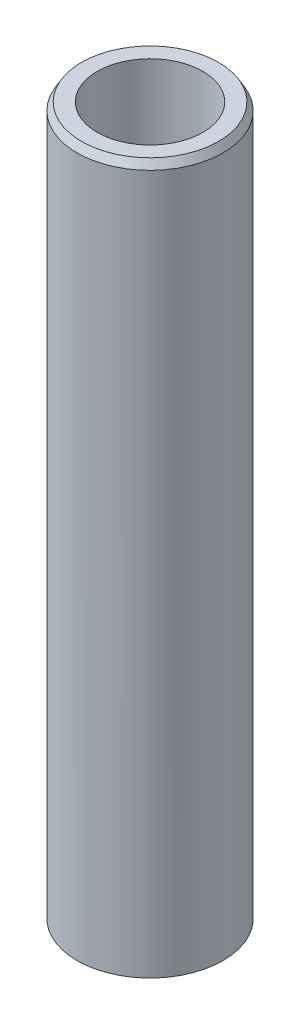
ISO-10303-21;
HEADER;
FILE_DESCRIPTION(('STEP AP214'),'2;1');
FILE_NAME('part.step','',(''),(''),'','','');
FILE_SCHEMA(('AUTOMOTIVE_DESIGN { 1 0 10303 214 1 1 1 1 }'));
ENDSEC;
DATA;
#1=APPLICATION_CONTEXT('core data for automotive mechanical design processes');
#2=APPLICATION_PROTOCOL_DEFINITION('international standard','automotive_design',2000,#1);
#3=PRODUCT_CONTEXT('',#1,'mechanical');
#4=PRODUCT('Part','Part','',(#3));
#5=PRODUCT_RELATED_PRODUCT_CATEGORY('part','',(#4));
#6=PRODUCT_DEFINITION_FORMATION('','',#4);
#7=PRODUCT_DEFINITION_CONTEXT('part definition',#1,'design');
#8=PRODUCT_DEFINITION('design','',#6,#7);
#9=PRODUCT_DEFINITION_SHAPE('','',#8);
#10=(LENGTH_UNIT() NAMED_UNIT(*) SI_UNIT(.MILLI.,.METRE.));
#11=(NAMED_UNIT(*) PLANE_ANGLE_UNIT() SI_UNIT($,.RADIAN.));
#12=(NAMED_UNIT(*) SI_UNIT($,.STERADIAN.) SOLID_ANGLE_UNIT());
#13=UNCERTAINTY_MEASURE_WITH_UNIT(LENGTH_MEASURE(1.E-05),#10,'distance_accuracy_value','');
#14=(GEOMETRIC_REPRESENTATION_CONTEXT(3) GLOBAL_UNCERTAINTY_ASSIGNED_CONTEXT((#13)) GLOBAL_UNIT_ASSIGNED_CONTEXT((#10,
#11,#12)) REPRESENTATION_CONTEXT('',''));
#15=CARTESIAN_POINT('',(0.,0.,0.));
#16=DIRECTION('',(0.,0.,1.));
#17=DIRECTION('',(1.,0.,0.));
#18=AXIS2_PLACEMENT_3D('',#15,#16,#17);
#19=CARTESIAN_POINT('',(0.,146.294640495275,0.));
#20=DIRECTION('',(0.,-1.,0.));
#21=DIRECTION('',(0.,0.,-1.));
#22=AXIS2_PLACEMENT_3D('',#19,#20,#21);
#23=CYLINDRICAL_SURFACE('',#22,15.);
#24=CARTESIAN_POINT('',(0.,144.707347437146,0.));
#25=DIRECTION('',(0.,1.,0.));
#26=DIRECTION('',(0.,0.,1.));
#27=AXIS2_PLACEMENT_3D('',#24,#25,#26);
#28=CIRCLE('',#27,15.);
#29=CARTESIAN_POINT('',(0.,144.707347437146,-15.));
#30=VERTEX_POINT('',#29);
#31=EDGE_CURVE('E50',#30,#30,#28,.F.);
#32=ORIENTED_EDGE('',*,*,#31,.T.);
#33=EDGE_LOOP('',(#32));
#34=FACE_BOUND('',#33,.T.);
#35=CARTESIAN_POINT('',(0.,0.916424074393407,0.));
#36=DIRECTION('',(0.,1.,0.));
#37=DIRECTION('',(0.,0.,1.));
#38=AXIS2_PLACEMENT_3D('',#35,#36,#37);
#39=CIRCLE('',#38,15.);
#40=CARTESIAN_POINT('',(0.,0.916424074393407,15.));
#41=VERTEX_POINT('',#40);
#42=EDGE_CURVE('E51',#41,#41,#39,.T.);
#43=ORIENTED_EDGE('',*,*,#42,.T.);
#44=EDGE_LOOP('',(#43));
#45=FACE_BOUND('',#44,.T.);
#46=ADVANCED_FACE('F39',(#34,#45),#23,.T.);
#47=CARTESIAN_POINT('',(0.,146.294640495275,0.));
#48=DIRECTION('',(0.,1.,0.));
#49=DIRECTION('',(0.,0.,1.));
#50=AXIS2_PLACEMENT_3D('',#47,#48,#49);
#51=PLANE('',#50);
#52=CARTESIAN_POINT('',(0.,146.294640495275,0.));
#53=DIRECTION('',(0.,1.,0.));
#54=DIRECTION('',(0.,0.,1.));
#55=AXIS2_PLACEMENT_3D('',#52,#53,#54);
#56=CIRCLE('',#55,14.0835759256066);
#57=CARTESIAN_POINT('',(0.,146.294640495275,-14.0835759256066));
#58=VERTEX_POINT('',#57);
#59=EDGE_CURVE('E54',#58,#58,#56,.T.);
#60=ORIENTED_EDGE('',*,*,#59,.T.);
#61=EDGE_LOOP('',(#60));
#62=FACE_BOUND('',#61,.T.);
#63=CARTESIAN_POINT('',(0.,146.294640495275,0.));
#64=DIRECTION('',(0.,1.,0.));
#65=DIRECTION('',(0.,0.,1.));
#66=AXIS2_PLACEMENT_3D('',#63,#64,#65);
#67=CIRCLE('',#66,10.8676698896352);
#68=CARTESIAN_POINT('',(0.,146.294640495275,10.8676698896352));
#69=VERTEX_POINT('',#68);
#70=EDGE_CURVE('E58',#69,#69,#67,.T.);
#71=ORIENTED_EDGE('',*,*,#70,.F.);
#72=EDGE_LOOP('',(#71));
#73=FACE_BOUND('',#72,.T.);
#74=ADVANCED_FACE('F69',(#62,#73),#51,.T.);
#75=CARTESIAN_POINT('',(0.,0.,0.));
#76=DIRECTION('',(0.,1.,0.));
#77=DIRECTION('',(0.,0.,1.));
#78=AXIS2_PLACEMENT_3D('',#75,#76,#77);
#79=PLANE('',#78);
#80=CARTESIAN_POINT('',(0.,0.,0.));
#81=DIRECTION('',(0.,1.,0.));
#82=DIRECTION('',(0.,0.,1.));
#83=AXIS2_PLACEMENT_3D('',#80,#81,#82);
#84=CIRCLE('',#83,13.4127069418713);
#85=CARTESIAN_POINT('',(0.,0.,13.4127069418713));
#86=VERTEX_POINT('',#85);
#87=EDGE_CURVE('E10',#86,#86,#84,.F.);
#88=ORIENTED_EDGE('',*,*,#87,.T.);
#89=EDGE_LOOP('',(#88));
#90=FACE_BOUND('',#89,.T.);
#91=CARTESIAN_POINT('',(0.,0.,0.));
#92=DIRECTION('',(0.,1.,0.));
#93=DIRECTION('',(0.,0.,1.));
#94=AXIS2_PLACEMENT_3D('',#91,#92,#93);
#95=CIRCLE('',#94,10.8676698896352);
#96=CARTESIAN_POINT('',(0.,0.,10.8676698896352));
#97=VERTEX_POINT('',#96);
#98=EDGE_CURVE('E63',#97,#97,#95,.T.);
#99=ORIENTED_EDGE('',*,*,#98,.T.);
#100=EDGE_LOOP('',(#99));
#101=FACE_BOUND('',#100,.T.);
#102=ADVANCED_FACE('F75',(#90,#101),#79,.F.);
#103=CARTESIAN_POINT('',(0.,146.294640495275,0.));
#104=DIRECTION('',(0.,-1.,0.));
#105=DIRECTION('',(0.,0.,-1.));
#106=AXIS2_PLACEMENT_3D('',#103,#104,#105);
#107=CYLINDRICAL_SURFACE('',#106,10.8676698896352);
#108=ORIENTED_EDGE('',*,*,#70,.T.);
#109=EDGE_LOOP('',(#108));
#110=FACE_BOUND('',#109,.T.);
#111=ORIENTED_EDGE('',*,*,#98,.F.);
#112=EDGE_LOOP('',(#111));
#113=FACE_BOUND('',#112,.T.);
#114=ADVANCED_FACE('F70',(#110,#113),#107,.F.);
#115=CARTESIAN_POINT('',(0.,146.294640495275,0.));
#116=DIRECTION('',(0.,-1.,0.));
#117=DIRECTION('',(0.,0.,-1.));
#118=AXIS2_PLACEMENT_3D('',#115,#116,#117);
#119=CONICAL_SURFACE('',#118,14.0835759256066,0.5235987755983);
#120=CARTESIAN_POINT('',(0.,144.707347437146,-15.));
#121=CARTESIAN_POINT('',(0.,144.723881739835,-14.9904539158917));
#122=CARTESIAN_POINT('',(0.,144.740416042524,-14.9809078317835));
#123=CARTESIAN_POINT('',(0.,144.773484647901,-14.961815663567));
#124=CARTESIAN_POINT('',(0.,144.79001895059,-14.9522695794587));
#125=CARTESIAN_POINT('',(0.,144.823087555968,-14.9331774112422));
#126=CARTESIAN_POINT('',(0.,144.839621858657,-14.9236313271339));
#127=CARTESIAN_POINT('',(0.,144.872690464034,-14.9045391589174));
#128=CARTESIAN_POINT('',(0.,144.889224766723,-14.8949930748091));
#129=CARTESIAN_POINT('',(0.,144.922293372101,-14.8759009065926));
#130=CARTESIAN_POINT('',(0.,144.93882767479,-14.8663548224843));
#131=CARTESIAN_POINT('',(0.,144.971896280167,-14.8472626542678));
#132=CARTESIAN_POINT('',(0.,144.988430582856,-14.8377165701595));
#133=CARTESIAN_POINT('',(0.,145.021499188234,-14.818624401943));
#134=CARTESIAN_POINT('',(0.,145.038033490923,-14.8090783178347));
#135=CARTESIAN_POINT('',(0.,145.0711020963,-14.7899861496182));
#136=CARTESIAN_POINT('',(0.,145.087636398989,-14.7804400655099));
#137=CARTESIAN_POINT('',(0.,145.120705004367,-14.7613478972934));
#138=CARTESIAN_POINT('',(0.,145.137239307056,-14.7518018131851));
#139=CARTESIAN_POINT('',(0.,145.170307912434,-14.7327096449686));
#140=CARTESIAN_POINT('',(0.,145.186842215122,-14.7231635608603));
#141=CARTESIAN_POINT('',(0.,145.2199108205,-14.7040713926438));
#142=CARTESIAN_POINT('',(0.,145.236445123189,-14.6945253085355));
#143=CARTESIAN_POINT('',(0.,145.269513728567,-14.675433140319));
#144=CARTESIAN_POINT('',(0.,145.286048031255,-14.6658870562107));
#145=CARTESIAN_POINT('',(0.,145.319116636633,-14.6467948879942));
#146=CARTESIAN_POINT('',(0.,145.335650939322,-14.637248803886));
#147=CARTESIAN_POINT('',(0.,145.3687195447,-14.6181566356694));
#148=CARTESIAN_POINT('',(0.,145.385253847388,-14.6086105515612));
#149=CARTESIAN_POINT('',(0.,145.418322452766,-14.5895183833446));
#150=CARTESIAN_POINT('',(0.,145.434856755455,-14.5799722992364));
#151=CARTESIAN_POINT('',(0.,145.467925360833,-14.5608801310198));
#152=CARTESIAN_POINT('',(0.,145.484459663522,-14.5513340469116));
#153=CARTESIAN_POINT('',(0.,145.517528268899,-14.532241878695));
#154=CARTESIAN_POINT('',(0.,145.534062571588,-14.5226957945868));
#155=CARTESIAN_POINT('',(0.,145.567131176966,-14.5036036263702));
#156=CARTESIAN_POINT('',(0.,145.583665479655,-14.494057542262));
#157=CARTESIAN_POINT('',(0.,145.616734085032,-14.4749653740455));
#158=CARTESIAN_POINT('',(0.,145.633268387721,-14.4654192899372));
#159=CARTESIAN_POINT('',(0.,145.666336993099,-14.4463271217207));
#160=CARTESIAN_POINT('',(0.,145.682871295788,-14.4367810376124));
#161=CARTESIAN_POINT('',(0.,145.715939901165,-14.4176888693959));
#162=CARTESIAN_POINT('',(0.,145.732474203854,-14.4081427852876));
#163=CARTESIAN_POINT('',(0.,145.765542809232,-14.3890506170711));
#164=CARTESIAN_POINT('',(0.,145.782077111921,-14.3795045329628));
#165=CARTESIAN_POINT('',(0.,145.815145717298,-14.3604123647463));
#166=CARTESIAN_POINT('',(0.,145.831680019987,-14.350866280638));
#167=CARTESIAN_POINT('',(0.,145.864748625365,-14.3317741124215));
#168=CARTESIAN_POINT('',(0.,145.881282928054,-14.3222280283132));
#169=CARTESIAN_POINT('',(0.,145.914351533431,-14.3031358600967));
#170=CARTESIAN_POINT('',(0.,145.93088583612,-14.2935897759884));
#171=CARTESIAN_POINT('',(0.,145.963954441498,-14.2744976077719));
#172=CARTESIAN_POINT('',(0.,145.980488744187,-14.2649515236636));
#173=CARTESIAN_POINT('',(0.,146.013557349564,-14.2458593554471));
#174=CARTESIAN_POINT('',(0.,146.030091652253,-14.2363132713388));
#175=CARTESIAN_POINT('',(0.,146.063160257631,-14.2172211031223));
#176=CARTESIAN_POINT('',(0.,146.07969456032,-14.207675019014));
#177=CARTESIAN_POINT('',(0.,146.112763165697,-14.1885828507975));
#178=CARTESIAN_POINT('',(0.,146.129297468386,-14.1790367666892));
#179=CARTESIAN_POINT('',(0.,146.162366073764,-14.1599445984727));
#180=CARTESIAN_POINT('',(0.,146.178900376453,-14.1503985143645));
#181=CARTESIAN_POINT('',(0.,146.21196898183,-14.1313063461479));
#182=CARTESIAN_POINT('',(0.,146.228503284519,-14.1217602620397));
#183=CARTESIAN_POINT('',(0.,146.261571889897,-14.1026680938231));
#184=CARTESIAN_POINT('',(0.,146.278106192586,-14.0931220097149));
#185=CARTESIAN_POINT('',(0.,146.294640495275,-14.0835759256066));
#186=B_SPLINE_CURVE_WITH_KNOTS('',3,(#120,#121,#122,#123,#124,#125,#126,#127,#128,#129,#130,
#131,#132,#133,#134,#135,#136,#137,#138,#139,#140,#141,#142,#143,#144,#145,#146,#147,#148,#149,
#150,#151,#152,#153,#154,#155,#156,#157,#158,#159,#160,#161,#162,#163,#164,#165,#166,#167,#168,
#169,#170,#171,#172,#173,#174,#175,#176,#177,#178,#179,#180,#181,#182,#183,#184,#185),
.UNSPECIFIED.,.F.,.F.,(4,2,2,2,2,2,2,2,2,2,2,2,2,2,2,2,2,2,2,2,2,2,2,2,2,2,2,2,2,2,2,2,4),(0.,
0.0572765046495878,0.114553009299176,0.171829513948764,0.229106018598351,0.286382523247939,
0.343659027897527,0.400935532547115,0.458212037196703,0.515488541846291,0.572765046495878,
0.630041551145466,0.687318055795054,0.744594560444642,0.80187106509423,0.859147569743818,
0.916424074393405,0.973700579042993,1.03097708369258,1.08825358834217,1.14553009299176,
1.20280659764135,1.26008310229093,1.31735960694052,1.37463611159011,1.4319126162397,
1.48918912088928,1.54646562553887,1.60374213018846,1.66101863483805,1.71829513948764,
1.77557164413722,1.83284814878681),.UNSPECIFIED.);
#187=EDGE_CURVE('BSEAM81',#30,#58,#186,.T.);
#188=ORIENTED_EDGE('',*,*,#31,.F.);
#189=ORIENTED_EDGE('',*,*,#59,.F.);
#190=ORIENTED_EDGE('',*,*,#187,.T.);
#191=ORIENTED_EDGE('',*,*,#187,.F.);
#192=EDGE_LOOP('',(#188,#190,#189,#191));
#193=FACE_BOUND('',#192,.T.);
#194=ADVANCED_FACE('F81',(#193),#119,.T.);
#195=CARTESIAN_POINT('',(0.,0.916424074393407,0.));
#196=DIRECTION('',(0.,1.,0.));
#197=DIRECTION('',(0.,0.,1.));
#198=AXIS2_PLACEMENT_3D('',#195,#196,#197);
#199=CONICAL_SURFACE('',#198,15.,1.0471975511966);
#200=ORIENTED_EDGE('',*,*,#87,.F.);
#201=EDGE_LOOP('',(#200));
#202=FACE_BOUND('',#201,.T.);
#203=ORIENTED_EDGE('',*,*,#42,.F.);
#204=EDGE_LOOP('',(#203));
#205=FACE_BOUND('',#204,.T.);
#206=ADVANCED_FACE('F45',(#202,#205),#199,.T.);
#207=CLOSED_SHELL('',(#46,#74,#102,#114,#194,#206));
#208=MANIFOLD_SOLID_BREP('B2',#207);
#209=ADVANCED_BREP_SHAPE_REPRESENTATION('',(#18,#208),#14);
#210=SHAPE_DEFINITION_REPRESENTATION(#9,#209);
ENDSEC;
END-ISO-10303-21;
